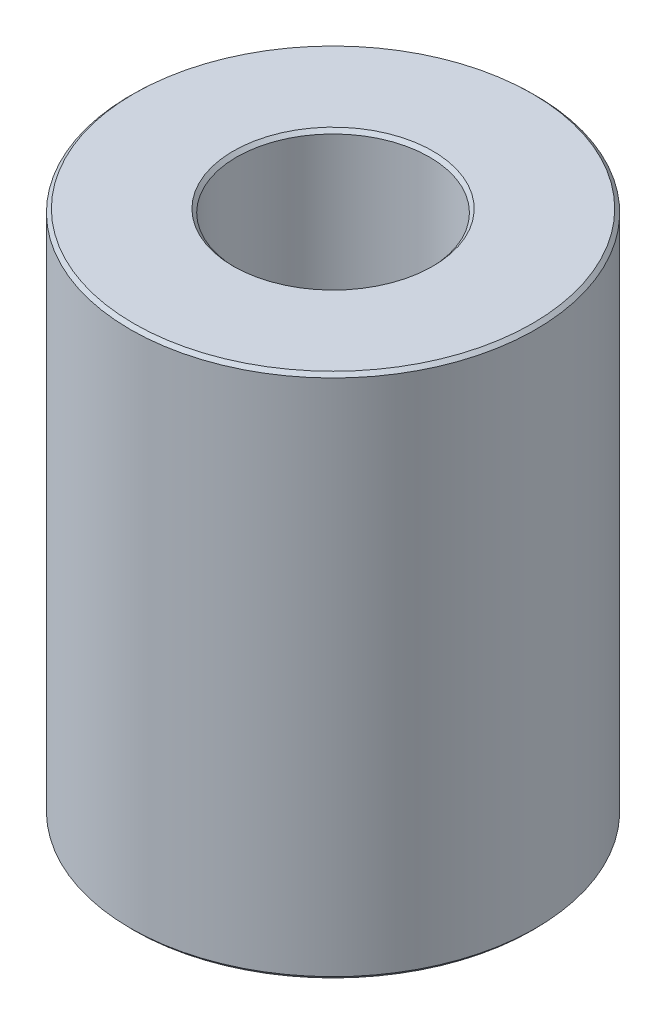
ISO-10303-21;
HEADER;
FILE_DESCRIPTION(('STEP AP214'),'2;1');
FILE_NAME('part.step','',(''),(''),'','','');
FILE_SCHEMA(('AUTOMOTIVE_DESIGN { 1 0 10303 214 1 1 1 1 }'));
ENDSEC;
DATA;
#1=APPLICATION_CONTEXT('core data for automotive mechanical design processes');
#2=APPLICATION_PROTOCOL_DEFINITION('international standard','automotive_design',2000,#1);
#3=PRODUCT_CONTEXT('',#1,'mechanical');
#4=PRODUCT('Part','Part','',(#3));
#5=PRODUCT_RELATED_PRODUCT_CATEGORY('part','',(#4));
#6=PRODUCT_DEFINITION_FORMATION('','',#4);
#7=PRODUCT_DEFINITION_CONTEXT('part definition',#1,'design');
#8=PRODUCT_DEFINITION('design','',#6,#7);
#9=PRODUCT_DEFINITION_SHAPE('','',#8);
#10=(LENGTH_UNIT() NAMED_UNIT(*) SI_UNIT(.MILLI.,.METRE.));
#11=(NAMED_UNIT(*) PLANE_ANGLE_UNIT() SI_UNIT($,.RADIAN.));
#12=(NAMED_UNIT(*) SI_UNIT($,.STERADIAN.) SOLID_ANGLE_UNIT());
#13=UNCERTAINTY_MEASURE_WITH_UNIT(LENGTH_MEASURE(1.E-05),#10,'distance_accuracy_value','');
#14=(GEOMETRIC_REPRESENTATION_CONTEXT(3) GLOBAL_UNCERTAINTY_ASSIGNED_CONTEXT((#13)) GLOBAL_UNIT_ASSIGNED_CONTEXT((#10,
#11,#12)) REPRESENTATION_CONTEXT('',''));
#15=CARTESIAN_POINT('',(0.,0.,0.));
#16=DIRECTION('',(0.,0.,1.));
#17=DIRECTION('',(1.,0.,0.));
#18=AXIS2_PLACEMENT_3D('',#15,#16,#17);
#19=CARTESIAN_POINT('',(0.,155.502326557665,0.));
#20=DIRECTION('',(0.,-1.,0.));
#21=DIRECTION('',(0.,0.,-1.));
#22=AXIS2_PLACEMENT_3D('',#19,#20,#21);
#23=CYLINDRICAL_SURFACE('',#22,60.);
#24=CARTESIAN_POINT('',(0.,1.04065719451563,0.));
#25=DIRECTION('',(0.,1.,0.));
#26=DIRECTION('',(0.,0.,1.));
#27=AXIS2_PLACEMENT_3D('',#24,#25,#26);
#28=CIRCLE('',#27,60.);
#29=CARTESIAN_POINT('',(0.,1.04065719451563,60.));
#30=VERTEX_POINT('',#29);
#31=EDGE_CURVE('E10',#30,#30,#28,.T.);
#32=ORIENTED_EDGE('',*,*,#31,.T.);
#33=EDGE_LOOP('',(#32));
#34=FACE_BOUND('',#33,.T.);
#35=CARTESIAN_POINT('',(0.,154.507553467713,0.));
#36=DIRECTION('',(0.,1.,0.));
#37=DIRECTION('',(0.,0.,1.));
#38=AXIS2_PLACEMENT_3D('',#35,#36,#37);
#39=CIRCLE('',#38,60.);
#40=CARTESIAN_POINT('',(0.,154.507553467713,60.));
#41=VERTEX_POINT('',#40);
#42=EDGE_CURVE('E50',#41,#41,#39,.F.);
#43=ORIENTED_EDGE('',*,*,#42,.T.);
#44=EDGE_LOOP('',(#43));
#45=FACE_BOUND('',#44,.T.);
#46=ADVANCED_FACE('F39',(#34,#45),#23,.T.);
#47=CARTESIAN_POINT('',(0.,155.502326557665,0.));
#48=DIRECTION('',(0.,1.,0.));
#49=DIRECTION('',(0.,0.,1.));
#50=AXIS2_PLACEMENT_3D('',#47,#48,#49);
#51=PLANE('',#50);
#52=CARTESIAN_POINT('',(0.,155.502326557665,0.));
#53=DIRECTION('',(0.,1.,0.));
#54=DIRECTION('',(0.,0.,1.));
#55=AXIS2_PLACEMENT_3D('',#52,#53,#54);
#56=CIRCLE('',#55,29.5446885200788);
#57=CARTESIAN_POINT('',(0.,155.502326557665,29.5446885200788));
#58=VERTEX_POINT('',#57);
#59=EDGE_CURVE('E58',#58,#58,#56,.F.);
#60=ORIENTED_EDGE('',*,*,#59,.T.);
#61=EDGE_LOOP('',(#60));
#62=FACE_BOUND('',#61,.T.);
#63=CARTESIAN_POINT('',(0.,155.502326557665,0.));
#64=DIRECTION('',(0.,1.,0.));
#65=DIRECTION('',(0.,0.,1.));
#66=AXIS2_PLACEMENT_3D('',#63,#64,#65);
#67=CIRCLE('',#66,58.9593428054843);
#68=CARTESIAN_POINT('',(0.,155.502326557665,58.9593428054843));
#69=VERTEX_POINT('',#68);
#70=EDGE_CURVE('E61',#69,#69,#67,.T.);
#71=ORIENTED_EDGE('',*,*,#70,.T.);
#72=EDGE_LOOP('',(#71));
#73=FACE_BOUND('',#72,.T.);
#74=ADVANCED_FACE('F88',(#62,#73),#51,.T.);
#75=CARTESIAN_POINT('',(0.,0.,0.));
#76=DIRECTION('',(0.,1.,0.));
#77=DIRECTION('',(0.,0.,1.));
#78=AXIS2_PLACEMENT_3D('',#75,#76,#77);
#79=PLANE('',#78);
#80=CARTESIAN_POINT('',(0.,0.,0.));
#81=DIRECTION('',(0.,1.,0.));
#82=DIRECTION('',(0.,0.,1.));
#83=AXIS2_PLACEMENT_3D('',#80,#81,#82);
#84=CIRCLE('',#83,29.5905726246427);
#85=CARTESIAN_POINT('',(0.,0.,29.5905726246427));
#86=VERTEX_POINT('',#85);
#87=EDGE_CURVE('E51',#86,#86,#84,.T.);
#88=ORIENTED_EDGE('',*,*,#87,.T.);
#89=EDGE_LOOP('',(#88));
#90=FACE_BOUND('',#89,.T.);
#91=CARTESIAN_POINT('',(0.,0.,0.));
#92=DIRECTION('',(0.,1.,0.));
#93=DIRECTION('',(0.,0.,1.));
#94=AXIS2_PLACEMENT_3D('',#91,#92,#93);
#95=CIRCLE('',#94,59.0052269100482);
#96=CARTESIAN_POINT('',(0.,0.,59.0052269100482));
#97=VERTEX_POINT('',#96);
#98=EDGE_CURVE('E54',#97,#97,#95,.F.);
#99=ORIENTED_EDGE('',*,*,#98,.T.);
#100=EDGE_LOOP('',(#99));
#101=FACE_BOUND('',#100,.T.);
#102=ADVANCED_FACE('F83',(#90,#101),#79,.F.);
#103=CARTESIAN_POINT('',(0.,155.502326557665,0.));
#104=DIRECTION('',(0.,-1.,0.));
#105=DIRECTION('',(0.,0.,-1.));
#106=AXIS2_PLACEMENT_3D('',#103,#104,#105);
#107=CYLINDRICAL_SURFACE('',#106,28.549915430127);
#108=CARTESIAN_POINT('',(0.,154.46166936315,0.));
#109=DIRECTION('',(0.,1.,0.));
#110=DIRECTION('',(0.,0.,1.));
#111=AXIS2_PLACEMENT_3D('',#108,#109,#110);
#112=CIRCLE('',#111,28.549915430127);
#113=CARTESIAN_POINT('',(0.,154.46166936315,28.549915430127));
#114=VERTEX_POINT('',#113);
#115=EDGE_CURVE('E67',#114,#114,#112,.T.);
#116=ORIENTED_EDGE('',*,*,#115,.T.);
#117=EDGE_LOOP('',(#116));
#118=FACE_BOUND('',#117,.T.);
#119=CARTESIAN_POINT('',(0.,0.9947730899518,0.));
#120=DIRECTION('',(0.,1.,0.));
#121=DIRECTION('',(0.,0.,1.));
#122=AXIS2_PLACEMENT_3D('',#119,#120,#121);
#123=CIRCLE('',#122,28.549915430127);
#124=CARTESIAN_POINT('',(0.,0.9947730899518,28.549915430127));
#125=VERTEX_POINT('',#124);
#126=EDGE_CURVE('E69',#125,#125,#123,.F.);
#127=ORIENTED_EDGE('',*,*,#126,.T.);
#128=EDGE_LOOP('',(#127));
#129=FACE_BOUND('',#128,.T.);
#130=ADVANCED_FACE('F71',(#118,#129),#107,.F.);
#131=CARTESIAN_POINT('',(0.,154.46166936315,0.));
#132=DIRECTION('',(0.,1.,0.));
#133=DIRECTION('',(0.,0.,1.));
#134=AXIS2_PLACEMENT_3D('',#131,#132,#133);
#135=CONICAL_SURFACE('',#134,28.549915430127,0.762859275713534);
#136=ORIENTED_EDGE('',*,*,#59,.F.);
#137=EDGE_LOOP('',(#136));
#138=FACE_BOUND('',#137,.T.);
#139=ORIENTED_EDGE('',*,*,#115,.F.);
#140=EDGE_LOOP('',(#139));
#141=FACE_BOUND('',#140,.T.);
#142=ADVANCED_FACE('F77',(#138,#141),#135,.F.);
#143=CARTESIAN_POINT('',(0.,0.,0.));
#144=DIRECTION('',(0.,-1.,0.));
#145=DIRECTION('',(0.,0.,-1.));
#146=AXIS2_PLACEMENT_3D('',#143,#144,#145);
#147=CONICAL_SURFACE('',#146,29.5905726246427,0.807937051081359);
#148=ORIENTED_EDGE('',*,*,#126,.F.);
#149=EDGE_LOOP('',(#148));
#150=FACE_BOUND('',#149,.T.);
#151=ORIENTED_EDGE('',*,*,#87,.F.);
#152=EDGE_LOOP('',(#151));
#153=FACE_BOUND('',#152,.T.);
#154=ADVANCED_FACE('F73',(#150,#153),#147,.F.);
#155=CARTESIAN_POINT('',(0.,1.04065719451563,0.));
#156=DIRECTION('',(0.,1.,0.));
#157=DIRECTION('',(0.,0.,1.));
#158=AXIS2_PLACEMENT_3D('',#155,#156,#157);
#159=CONICAL_SURFACE('',#158,60.,0.762859275713539);
#160=ORIENTED_EDGE('',*,*,#98,.F.);
#161=EDGE_LOOP('',(#160));
#162=FACE_BOUND('',#161,.T.);
#163=ORIENTED_EDGE('',*,*,#31,.F.);
#164=EDGE_LOOP('',(#163));
#165=FACE_BOUND('',#164,.T.);
#166=ADVANCED_FACE('F76',(#162,#165),#159,.T.);
#167=CARTESIAN_POINT('',(0.,155.502326557665,0.));
#168=DIRECTION('',(0.,-1.,0.));
#169=DIRECTION('',(0.,0.,-1.));
#170=AXIS2_PLACEMENT_3D('',#167,#168,#169);
#171=CONICAL_SURFACE('',#170,58.9593428054843,0.807937051081353);
#172=ORIENTED_EDGE('',*,*,#42,.F.);
#173=EDGE_LOOP('',(#172));
#174=FACE_BOUND('',#173,.T.);
#175=ORIENTED_EDGE('',*,*,#70,.F.);
#176=EDGE_LOOP('',(#175));
#177=FACE_BOUND('',#176,.T.);
#178=ADVANCED_FACE('F45',(#174,#177),#171,.T.);
#179=CLOSED_SHELL('',(#46,#74,#102,#130,#142,#154,#166,#178));
#180=MANIFOLD_SOLID_BREP('B2',#179);
#181=ADVANCED_BREP_SHAPE_REPRESENTATION('',(#18,#180),#14);
#182=SHAPE_DEFINITION_REPRESENTATION(#9,#181);
ENDSEC;
END-ISO-10303-21;
